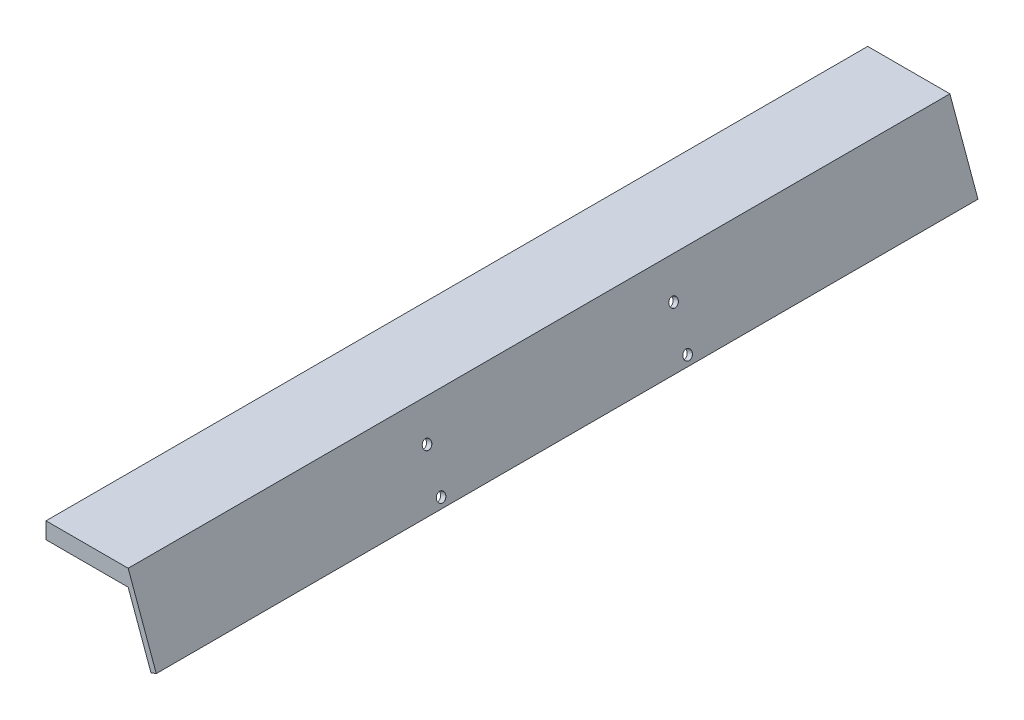
ISO-10303-21;
HEADER;
FILE_DESCRIPTION(('STEP AP214'),'2;1');
FILE_NAME('part.step','',(''),(''),'','','');
FILE_SCHEMA(('AUTOMOTIVE_DESIGN { 1 0 10303 214 1 1 1 1 }'));
ENDSEC;
DATA;
#1=APPLICATION_CONTEXT('core data for automotive mechanical design processes');
#2=APPLICATION_PROTOCOL_DEFINITION('international standard','automotive_design',2000,#1);
#3=PRODUCT_CONTEXT('',#1,'mechanical');
#4=PRODUCT('Part','Part','',(#3));
#5=PRODUCT_RELATED_PRODUCT_CATEGORY('part','',(#4));
#6=PRODUCT_DEFINITION_FORMATION('','',#4);
#7=PRODUCT_DEFINITION_CONTEXT('part definition',#1,'design');
#8=PRODUCT_DEFINITION('design','',#6,#7);
#9=PRODUCT_DEFINITION_SHAPE('','',#8);
#10=(LENGTH_UNIT() NAMED_UNIT(*) SI_UNIT(.MILLI.,.METRE.));
#11=(NAMED_UNIT(*) PLANE_ANGLE_UNIT() SI_UNIT($,.RADIAN.));
#12=(NAMED_UNIT(*) SI_UNIT($,.STERADIAN.) SOLID_ANGLE_UNIT());
#13=UNCERTAINTY_MEASURE_WITH_UNIT(LENGTH_MEASURE(1.E-05),#10,'distance_accuracy_value','');
#14=(GEOMETRIC_REPRESENTATION_CONTEXT(3) GLOBAL_UNCERTAINTY_ASSIGNED_CONTEXT((#13)) GLOBAL_UNIT_ASSIGNED_CONTEXT((#10,
#11,#12)) REPRESENTATION_CONTEXT('',''));
#15=CARTESIAN_POINT('',(0.,0.,0.));
#16=DIRECTION('',(0.,0.,1.));
#17=DIRECTION('',(1.,0.,0.));
#18=AXIS2_PLACEMENT_3D('',#15,#16,#17);
#19=CARTESIAN_POINT('',(0.,-10.,500.));
#20=DIRECTION('',(1.,0.,0.));
#21=DIRECTION('',(0.,0.,-1.));
#22=AXIS2_PLACEMENT_3D('',#19,#20,#21);
#23=PLANE('',#22);
#24=DIRECTION('',(0.,-1.,0.));
#25=VECTOR('',#24,1.);
#26=CARTESIAN_POINT('',(0.,-10.,0.));
#27=LINE('',#26,#25);
#28=CARTESIAN_POINT('',(0.,0.,0.));
#29=VERTEX_POINT('',#28);
#30=CARTESIAN_POINT('',(0.,-10.,0.));
#31=VERTEX_POINT('',#30);
#32=EDGE_CURVE('E136',#29,#31,#27,.T.);
#33=ORIENTED_EDGE('',*,*,#32,.T.);
#34=DIRECTION('',(0.,0.,-1.));
#35=VECTOR('',#34,1.);
#36=CARTESIAN_POINT('',(0.,-10.,500.));
#37=LINE('',#36,#35);
#38=CARTESIAN_POINT('',(0.,-10.,500.));
#39=VERTEX_POINT('',#38);
#40=EDGE_CURVE('E11',#39,#31,#37,.T.);
#41=ORIENTED_EDGE('',*,*,#40,.F.);
#42=DIRECTION('',(0.,-1.,0.));
#43=VECTOR('',#42,1.);
#44=CARTESIAN_POINT('',(0.,-10.,500.));
#45=LINE('',#44,#43);
#46=CARTESIAN_POINT('',(0.,0.,500.));
#47=VERTEX_POINT('',#46);
#48=EDGE_CURVE('E153',#47,#39,#45,.T.);
#49=ORIENTED_EDGE('',*,*,#48,.F.);
#50=DIRECTION('',(0.,0.,-1.));
#51=VECTOR('',#50,1.);
#52=CARTESIAN_POINT('',(0.,0.,500.));
#53=LINE('',#52,#51);
#54=EDGE_CURVE('E132',#47,#29,#53,.T.);
#55=ORIENTED_EDGE('',*,*,#54,.T.);
#56=EDGE_LOOP('',(#33,#41,#49,#55));
#57=FACE_BOUND('',#56,.T.);
#58=ADVANCED_FACE('F45',(#57),#23,.F.);
#59=CARTESIAN_POINT('',(50.,-9.99999999999999,500.));
#60=DIRECTION('',(0.,1.,0.));
#61=DIRECTION('',(-1.,0.,0.));
#62=AXIS2_PLACEMENT_3D('',#59,#60,#61);
#63=PLANE('',#62);
#64=DIRECTION('',(1.,0.,0.));
#65=VECTOR('',#64,1.);
#66=CARTESIAN_POINT('',(50.,-9.99999999999999,0.));
#67=LINE('',#66,#65);
#68=CARTESIAN_POINT('',(50.,-9.99999999999999,0.));
#69=VERTEX_POINT('',#68);
#70=EDGE_CURVE('E140',#31,#69,#67,.T.);
#71=ORIENTED_EDGE('',*,*,#70,.T.);
#72=DIRECTION('',(0.,0.,-1.));
#73=VECTOR('',#72,1.);
#74=CARTESIAN_POINT('',(50.,-9.99999999999999,500.));
#75=LINE('',#74,#73);
#76=CARTESIAN_POINT('',(50.,-9.99999999999999,500.));
#77=VERTEX_POINT('',#76);
#78=EDGE_CURVE('E55',#77,#69,#75,.T.);
#79=ORIENTED_EDGE('',*,*,#78,.F.);
#80=DIRECTION('',(1.,0.,0.));
#81=VECTOR('',#80,1.);
#82=CARTESIAN_POINT('',(50.,-9.99999999999999,500.));
#83=LINE('',#82,#81);
#84=EDGE_CURVE('E101',#39,#77,#83,.T.);
#85=ORIENTED_EDGE('',*,*,#84,.F.);
#86=ORIENTED_EDGE('',*,*,#40,.T.);
#87=EDGE_LOOP('',(#71,#79,#85,#86));
#88=FACE_BOUND('',#87,.T.);
#89=ADVANCED_FACE('F208',(#88),#63,.F.);
#90=CARTESIAN_POINT('',(63.8870691178505,-48.1544088237006,500.));
#91=DIRECTION('',(0.939692620785911,0.342020143325663,0.));
#92=DIRECTION('',(-0.342020143325663,0.93969262078591,0.));
#93=AXIS2_PLACEMENT_3D('',#90,#91,#92);
#94=PLANE('',#93);
#95=CARTESIAN_POINT('',(53.6404510040889,-20.0020569303652,325.));
#96=DIRECTION('',(0.939692620785911,0.342020143325663,0.));
#97=DIRECTION('',(-0.342020143325663,0.93969262078591,0.));
#98=AXIS2_PLACEMENT_3D('',#95,#96,#97);
#99=CIRCLE('',#98,2.74999999999997);
#100=CARTESIAN_POINT('',(52.6998956099433,-17.417902223204,325.));
#101=VERTEX_POINT('',#100);
#102=EDGE_CURVE('E48',#101,#101,#99,.T.);
#103=ORIENTED_EDGE('',*,*,#102,.T.);
#104=EDGE_LOOP('',(#103));
#105=FACE_BOUND('',#104,.T.);
#106=CARTESIAN_POINT('',(62.1909545872304,-43.494372450013,325.));
#107=DIRECTION('',(0.939692620785911,0.342020143325663,0.));
#108=DIRECTION('',(-0.342020143325663,0.93969262078591,0.));
#109=AXIS2_PLACEMENT_3D('',#106,#107,#108);
#110=CIRCLE('',#109,2.74999999999997);
#111=CARTESIAN_POINT('',(61.2503991930849,-40.9102177428518,325.));
#112=VERTEX_POINT('',#111);
#113=EDGE_CURVE('E172',#112,#112,#110,.T.);
#114=ORIENTED_EDGE('',*,*,#113,.T.);
#115=EDGE_LOOP('',(#114));
#116=FACE_BOUND('',#115,.T.);
#117=CARTESIAN_POINT('',(62.1909545872304,-43.494372450013,175.));
#118=DIRECTION('',(0.939692620785911,0.342020143325663,0.));
#119=DIRECTION('',(-0.342020143325663,0.93969262078591,0.));
#120=AXIS2_PLACEMENT_3D('',#117,#118,#119);
#121=CIRCLE('',#120,2.74999999999999);
#122=CARTESIAN_POINT('',(61.2503991930849,-40.9102177428517,175.));
#123=VERTEX_POINT('',#122);
#124=EDGE_CURVE('E167',#123,#123,#121,.T.);
#125=ORIENTED_EDGE('',*,*,#124,.T.);
#126=EDGE_LOOP('',(#125));
#127=FACE_BOUND('',#126,.T.);
#128=CARTESIAN_POINT('',(53.6404510040889,-20.0020569303652,175.));
#129=DIRECTION('',(0.939692620785911,0.342020143325663,0.));
#130=DIRECTION('',(-0.342020143325663,0.93969262078591,0.));
#131=AXIS2_PLACEMENT_3D('',#128,#129,#130);
#132=CIRCLE('',#131,2.74999999999999);
#133=CARTESIAN_POINT('',(52.6998956099433,-17.417902223204,175.));
#134=VERTEX_POINT('',#133);
#135=EDGE_CURVE('E141',#134,#134,#132,.T.);
#136=ORIENTED_EDGE('',*,*,#135,.T.);
#137=EDGE_LOOP('',(#136));
#138=FACE_BOUND('',#137,.T.);
#139=DIRECTION('',(0.342020143325663,-0.93969262078591,0.));
#140=VECTOR('',#139,1.);
#141=CARTESIAN_POINT('',(63.8870691178505,-48.1544088237006,0.));
#142=LINE('',#141,#140);
#143=CARTESIAN_POINT('',(63.8870691178505,-48.1544088237006,0.));
#144=VERTEX_POINT('',#143);
#145=EDGE_CURVE('E144',#69,#144,#142,.T.);
#146=ORIENTED_EDGE('',*,*,#145,.T.);
#147=DIRECTION('',(0.,0.,-1.));
#148=VECTOR('',#147,1.);
#149=CARTESIAN_POINT('',(63.8870691178505,-48.1544088237006,500.));
#150=LINE('',#149,#148);
#151=CARTESIAN_POINT('',(63.8870691178505,-48.1544088237006,500.));
#152=VERTEX_POINT('',#151);
#153=EDGE_CURVE('E125',#152,#144,#150,.T.);
#154=ORIENTED_EDGE('',*,*,#153,.F.);
#155=DIRECTION('',(0.342020143325663,-0.93969262078591,0.));
#156=VECTOR('',#155,1.);
#157=CARTESIAN_POINT('',(63.8870691178505,-48.1544088237006,500.));
#158=LINE('',#157,#156);
#159=EDGE_CURVE('E114',#77,#152,#158,.T.);
#160=ORIENTED_EDGE('',*,*,#159,.F.);
#161=ORIENTED_EDGE('',*,*,#78,.T.);
#162=EDGE_LOOP('',(#146,#154,#160,#161));
#163=FACE_BOUND('',#162,.T.);
#164=ADVANCED_FACE('F211',(#105,#116,#127,#138,#163),#94,.F.);
#165=CARTESIAN_POINT('',(67.1010071662832,-46.9846310392955,500.));
#166=DIRECTION('',(-0.342020143325664,0.93969262078591,0.));
#167=DIRECTION('',(-0.93969262078591,-0.342020143325664,0.));
#168=AXIS2_PLACEMENT_3D('',#165,#166,#167);
#169=PLANE('',#168);
#170=DIRECTION('',(0.93969262078591,0.342020143325664,0.));
#171=VECTOR('',#170,1.);
#172=CARTESIAN_POINT('',(67.1010071662832,-46.9846310392955,0.));
#173=LINE('',#172,#171);
#174=CARTESIAN_POINT('',(67.1010071662832,-46.9846310392955,0.));
#175=VERTEX_POINT('',#174);
#176=EDGE_CURVE('E123',#144,#175,#173,.T.);
#177=ORIENTED_EDGE('',*,*,#176,.T.);
#178=DIRECTION('',(0.,0.,-1.));
#179=VECTOR('',#178,1.);
#180=CARTESIAN_POINT('',(67.1010071662832,-46.9846310392955,500.));
#181=LINE('',#180,#179);
#182=CARTESIAN_POINT('',(67.1010071662832,-46.9846310392955,500.));
#183=VERTEX_POINT('',#182);
#184=EDGE_CURVE('E120',#183,#175,#181,.T.);
#185=ORIENTED_EDGE('',*,*,#184,.F.);
#186=DIRECTION('',(0.93969262078591,0.342020143325664,0.));
#187=VECTOR('',#186,1.);
#188=CARTESIAN_POINT('',(67.1010071662832,-46.9846310392955,500.));
#189=LINE('',#188,#187);
#190=EDGE_CURVE('E108',#152,#183,#189,.T.);
#191=ORIENTED_EDGE('',*,*,#190,.F.);
#192=ORIENTED_EDGE('',*,*,#153,.T.);
#193=EDGE_LOOP('',(#177,#185,#191,#192));
#194=FACE_BOUND('',#193,.T.);
#195=ADVANCED_FACE('F121',(#194),#169,.F.);
#196=CARTESIAN_POINT('',(50.,0.,500.));
#197=DIRECTION('',(-0.93969262078591,-0.342020143325663,0.));
#198=DIRECTION('',(0.342020143325663,-0.93969262078591,0.));
#199=AXIS2_PLACEMENT_3D('',#196,#197,#198);
#200=PLANE('',#199);
#201=CARTESIAN_POINT('',(56.8543890525215,-18.8322791459602,325.));
#202=DIRECTION('',(0.93969262078591,0.342020143325663,0.));
#203=DIRECTION('',(-0.342020143325663,0.93969262078591,0.));
#204=AXIS2_PLACEMENT_3D('',#201,#202,#203);
#205=CIRCLE('',#204,2.77500000000003);
#206=CARTESIAN_POINT('',(55.9052831547928,-16.2246321232792,325.));
#207=VERTEX_POINT('',#206);
#208=EDGE_CURVE('E430',#207,#207,#205,.T.);
#209=ORIENTED_EDGE('',*,*,#208,.F.);
#210=EDGE_LOOP('',(#209));
#211=FACE_BOUND('',#210,.T.);
#212=CARTESIAN_POINT('',(65.4048926356631,-42.3245946656079,325.));
#213=DIRECTION('',(0.93969262078591,0.342020143325663,0.));
#214=DIRECTION('',(-0.342020143325663,0.93969262078591,0.));
#215=AXIS2_PLACEMENT_3D('',#212,#213,#214);
#216=CIRCLE('',#215,2.77500000000003);
#217=CARTESIAN_POINT('',(64.4557867379344,-39.716947642927,325.));
#218=VERTEX_POINT('',#217);
#219=EDGE_CURVE('E184',#218,#218,#216,.T.);
#220=ORIENTED_EDGE('',*,*,#219,.F.);
#221=EDGE_LOOP('',(#220));
#222=FACE_BOUND('',#221,.T.);
#223=CARTESIAN_POINT('',(65.4048926356631,-42.3245946656079,175.));
#224=DIRECTION('',(0.93969262078591,0.342020143325663,0.));
#225=DIRECTION('',(-0.342020143325663,0.93969262078591,0.));
#226=AXIS2_PLACEMENT_3D('',#223,#224,#225);
#227=CIRCLE('',#226,2.775);
#228=CARTESIAN_POINT('',(64.4557867379344,-39.716947642927,175.));
#229=VERTEX_POINT('',#228);
#230=EDGE_CURVE('E175',#229,#229,#227,.T.);
#231=ORIENTED_EDGE('',*,*,#230,.F.);
#232=EDGE_LOOP('',(#231));
#233=FACE_BOUND('',#232,.T.);
#234=CARTESIAN_POINT('',(56.8543890525215,-18.8322791459601,175.));
#235=DIRECTION('',(0.93969262078591,0.342020143325663,0.));
#236=DIRECTION('',(-0.342020143325663,0.93969262078591,0.));
#237=AXIS2_PLACEMENT_3D('',#234,#235,#236);
#238=CIRCLE('',#237,2.775);
#239=CARTESIAN_POINT('',(55.9052831547928,-16.2246321232792,175.));
#240=VERTEX_POINT('',#239);
#241=EDGE_CURVE('E170',#240,#240,#238,.T.);
#242=ORIENTED_EDGE('',*,*,#241,.F.);
#243=EDGE_LOOP('',(#242));
#244=FACE_BOUND('',#243,.T.);
#245=DIRECTION('',(-0.342020143325663,0.93969262078591,0.));
#246=VECTOR('',#245,1.);
#247=CARTESIAN_POINT('',(50.,0.,0.));
#248=LINE('',#247,#246);
#249=CARTESIAN_POINT('',(50.,0.,0.));
#250=VERTEX_POINT('',#249);
#251=EDGE_CURVE('E87',#175,#250,#248,.T.);
#252=ORIENTED_EDGE('',*,*,#251,.T.);
#253=DIRECTION('',(0.,0.,-1.));
#254=VECTOR('',#253,1.);
#255=CARTESIAN_POINT('',(50.,0.,500.));
#256=LINE('',#255,#254);
#257=CARTESIAN_POINT('',(50.,0.,500.));
#258=VERTEX_POINT('',#257);
#259=EDGE_CURVE('E126',#258,#250,#256,.T.);
#260=ORIENTED_EDGE('',*,*,#259,.F.);
#261=DIRECTION('',(-0.342020143325663,0.93969262078591,0.));
#262=VECTOR('',#261,1.);
#263=CARTESIAN_POINT('',(50.,0.,500.));
#264=LINE('',#263,#262);
#265=EDGE_CURVE('E112',#183,#258,#264,.T.);
#266=ORIENTED_EDGE('',*,*,#265,.F.);
#267=ORIENTED_EDGE('',*,*,#184,.T.);
#268=EDGE_LOOP('',(#252,#260,#266,#267));
#269=FACE_BOUND('',#268,.T.);
#270=ADVANCED_FACE('F128',(#211,#222,#233,#244,#269),#200,.F.);
#271=CARTESIAN_POINT('',(0.,0.,500.));
#272=DIRECTION('',(0.,-1.,0.));
#273=DIRECTION('',(0.,0.,-1.));
#274=AXIS2_PLACEMENT_3D('',#271,#272,#273);
#275=PLANE('',#274);
#276=DIRECTION('',(-1.,0.,0.));
#277=VECTOR('',#276,1.);
#278=CARTESIAN_POINT('',(0.,0.,0.));
#279=LINE('',#278,#277);
#280=EDGE_CURVE('E93',#250,#29,#279,.T.);
#281=ORIENTED_EDGE('',*,*,#280,.T.);
#282=ORIENTED_EDGE('',*,*,#54,.F.);
#283=DIRECTION('',(-1.,0.,0.));
#284=VECTOR('',#283,1.);
#285=CARTESIAN_POINT('',(0.,0.,500.));
#286=LINE('',#285,#284);
#287=EDGE_CURVE('E64',#258,#47,#286,.T.);
#288=ORIENTED_EDGE('',*,*,#287,.F.);
#289=ORIENTED_EDGE('',*,*,#259,.T.);
#290=EDGE_LOOP('',(#281,#282,#288,#289));
#291=FACE_BOUND('',#290,.T.);
#292=ADVANCED_FACE('F216',(#291),#275,.F.);
#293=CARTESIAN_POINT('',(0.,0.,500.));
#294=DIRECTION('',(0.,0.,-1.));
#295=DIRECTION('',(-1.,0.,0.));
#296=AXIS2_PLACEMENT_3D('',#293,#294,#295);
#297=PLANE('',#296);
#298=ORIENTED_EDGE('',*,*,#48,.T.);
#299=ORIENTED_EDGE('',*,*,#84,.T.);
#300=ORIENTED_EDGE('',*,*,#159,.T.);
#301=ORIENTED_EDGE('',*,*,#190,.T.);
#302=ORIENTED_EDGE('',*,*,#265,.T.);
#303=ORIENTED_EDGE('',*,*,#287,.T.);
#304=EDGE_LOOP('',(#298,#299,#300,#301,#302,#303));
#305=FACE_BOUND('',#304,.T.);
#306=ADVANCED_FACE('F110',(#305),#297,.F.);
#307=CARTESIAN_POINT('',(0.,0.,0.));
#308=DIRECTION('',(0.,0.,-1.));
#309=DIRECTION('',(-1.,0.,0.));
#310=AXIS2_PLACEMENT_3D('',#307,#308,#309);
#311=PLANE('',#310);
#312=ORIENTED_EDGE('',*,*,#32,.F.);
#313=ORIENTED_EDGE('',*,*,#280,.F.);
#314=ORIENTED_EDGE('',*,*,#251,.F.);
#315=ORIENTED_EDGE('',*,*,#176,.F.);
#316=ORIENTED_EDGE('',*,*,#145,.F.);
#317=ORIENTED_EDGE('',*,*,#70,.F.);
#318=EDGE_LOOP('',(#312,#313,#314,#315,#316,#317));
#319=FACE_BOUND('',#318,.T.);
#320=ADVANCED_FACE('F214',(#319),#311,.T.);
#321=CARTESIAN_POINT('',(56.8543890525215,-18.8322791459601,175.));
#322=DIRECTION('',(0.93969262078591,0.342020143325663,0.));
#323=DIRECTION('',(-0.342020143325663,0.93969262078591,0.));
#324=AXIS2_PLACEMENT_3D('',#321,#322,#323);
#325=CYLINDRICAL_SURFACE('',#324,2.74999999999999);
#326=CARTESIAN_POINT('',(56.8308967370019,-18.8408296495433,175.));
#327=DIRECTION('',(0.93969262078591,0.342020143325663,0.));
#328=DIRECTION('',(-0.342020143325663,0.93969262078591,0.));
#329=AXIS2_PLACEMENT_3D('',#326,#327,#328);
#330=CIRCLE('',#329,2.75);
#331=CARTESIAN_POINT('',(55.8903413428563,-16.256674942382,175.));
#332=VERTEX_POINT('',#331);
#333=EDGE_CURVE('E166',#332,#332,#330,.T.);
#334=ORIENTED_EDGE('',*,*,#333,.T.);
#335=EDGE_LOOP('',(#334));
#336=FACE_BOUND('',#335,.T.);
#337=ORIENTED_EDGE('',*,*,#135,.F.);
#338=EDGE_LOOP('',(#337));
#339=FACE_BOUND('',#338,.T.);
#340=ADVANCED_FACE('F267',(#336,#339),#325,.F.);
#341=CARTESIAN_POINT('',(56.8543890525215,-18.8322791459601,175.));
#342=DIRECTION('',(0.93969262078591,0.342020143325663,0.));
#343=DIRECTION('',(-0.342020143325663,0.93969262078591,0.));
#344=AXIS2_PLACEMENT_3D('',#341,#342,#343);
#345=CONICAL_SURFACE('',#344,2.775,0.785398163397146);
#346=ORIENTED_EDGE('',*,*,#333,.F.);
#347=EDGE_LOOP('',(#346));
#348=FACE_BOUND('',#347,.T.);
#349=ORIENTED_EDGE('',*,*,#241,.T.);
#350=EDGE_LOOP('',(#349));
#351=FACE_BOUND('',#350,.T.);
#352=ADVANCED_FACE('F274',(#348,#351),#345,.F.);
#353=CARTESIAN_POINT('',(65.4048926356631,-42.3245946656079,175.));
#354=DIRECTION('',(0.93969262078591,0.342020143325663,0.));
#355=DIRECTION('',(-0.342020143325663,0.93969262078591,0.));
#356=AXIS2_PLACEMENT_3D('',#353,#354,#355);
#357=CYLINDRICAL_SURFACE('',#356,2.74999999999999);
#358=CARTESIAN_POINT('',(65.3814003201434,-42.3331451691911,175.));
#359=DIRECTION('',(0.93969262078591,0.342020143325663,0.));
#360=DIRECTION('',(-0.342020143325663,0.93969262078591,0.));
#361=AXIS2_PLACEMENT_3D('',#358,#359,#360);
#362=CIRCLE('',#361,2.75);
#363=CARTESIAN_POINT('',(64.4408449259979,-39.7489904620298,175.));
#364=VERTEX_POINT('',#363);
#365=EDGE_CURVE('E171',#364,#364,#362,.T.);
#366=ORIENTED_EDGE('',*,*,#365,.T.);
#367=EDGE_LOOP('',(#366));
#368=FACE_BOUND('',#367,.T.);
#369=ORIENTED_EDGE('',*,*,#124,.F.);
#370=EDGE_LOOP('',(#369));
#371=FACE_BOUND('',#370,.T.);
#372=ADVANCED_FACE('F284',(#368,#371),#357,.F.);
#373=CARTESIAN_POINT('',(65.4048926356631,-42.3245946656079,175.));
#374=DIRECTION('',(0.93969262078591,0.342020143325663,0.));
#375=DIRECTION('',(-0.342020143325663,0.93969262078591,0.));
#376=AXIS2_PLACEMENT_3D('',#373,#374,#375);
#377=CONICAL_SURFACE('',#376,2.775,0.7853981633973);
#378=ORIENTED_EDGE('',*,*,#365,.F.);
#379=EDGE_LOOP('',(#378));
#380=FACE_BOUND('',#379,.T.);
#381=ORIENTED_EDGE('',*,*,#230,.T.);
#382=EDGE_LOOP('',(#381));
#383=FACE_BOUND('',#382,.T.);
#384=ADVANCED_FACE('F294',(#380,#383),#377,.F.);
#385=CARTESIAN_POINT('',(65.4048926356631,-42.3245946656079,325.));
#386=DIRECTION('',(0.93969262078591,0.342020143325663,0.));
#387=DIRECTION('',(-0.342020143325663,0.93969262078591,0.));
#388=AXIS2_PLACEMENT_3D('',#385,#386,#387);
#389=CYLINDRICAL_SURFACE('',#388,2.74999999999997);
#390=CARTESIAN_POINT('',(65.3814003201434,-42.3331451691911,325.));
#391=DIRECTION('',(0.93969262078591,0.342020143325663,0.));
#392=DIRECTION('',(-0.342020143325663,0.93969262078591,0.));
#393=AXIS2_PLACEMENT_3D('',#390,#391,#392);
#394=CIRCLE('',#393,2.74999999999997);
#395=CARTESIAN_POINT('',(64.4408449259979,-39.7489904620298,325.));
#396=VERTEX_POINT('',#395);
#397=EDGE_CURVE('E176',#396,#396,#394,.T.);
#398=ORIENTED_EDGE('',*,*,#397,.T.);
#399=EDGE_LOOP('',(#398));
#400=FACE_BOUND('',#399,.T.);
#401=ORIENTED_EDGE('',*,*,#113,.F.);
#402=EDGE_LOOP('',(#401));
#403=FACE_BOUND('',#402,.T.);
#404=ADVANCED_FACE('F304',(#400,#403),#389,.F.);
#405=CARTESIAN_POINT('',(65.4048926356631,-42.3245946656079,325.));
#406=DIRECTION('',(0.93969262078591,0.342020143325663,0.));
#407=DIRECTION('',(-0.342020143325663,0.93969262078591,0.));
#408=AXIS2_PLACEMENT_3D('',#405,#406,#407);
#409=CONICAL_SURFACE('',#408,2.77500000000003,0.78539816339841);
#410=ORIENTED_EDGE('',*,*,#397,.F.);
#411=EDGE_LOOP('',(#410));
#412=FACE_BOUND('',#411,.T.);
#413=ORIENTED_EDGE('',*,*,#219,.T.);
#414=EDGE_LOOP('',(#413));
#415=FACE_BOUND('',#414,.T.);
#416=ADVANCED_FACE('F314',(#412,#415),#409,.F.);
#417=CARTESIAN_POINT('',(56.8543890525215,-18.8322791459602,325.));
#418=DIRECTION('',(0.93969262078591,0.342020143325663,0.));
#419=DIRECTION('',(-0.342020143325663,0.93969262078591,0.));
#420=AXIS2_PLACEMENT_3D('',#417,#418,#419);
#421=CYLINDRICAL_SURFACE('',#420,2.74999999999997);
#422=CARTESIAN_POINT('',(56.8308967370019,-18.8408296495433,325.));
#423=DIRECTION('',(0.93969262078591,0.342020143325663,0.));
#424=DIRECTION('',(-0.342020143325663,0.93969262078591,0.));
#425=AXIS2_PLACEMENT_3D('',#422,#423,#424);
#426=CIRCLE('',#425,2.74999999999997);
#427=CARTESIAN_POINT('',(55.8903413428563,-16.2566749423821,325.));
#428=VERTEX_POINT('',#427);
#429=EDGE_CURVE('E427',#428,#428,#426,.T.);
#430=ORIENTED_EDGE('',*,*,#429,.T.);
#431=EDGE_LOOP('',(#430));
#432=FACE_BOUND('',#431,.T.);
#433=ORIENTED_EDGE('',*,*,#102,.F.);
#434=EDGE_LOOP('',(#433));
#435=FACE_BOUND('',#434,.T.);
#436=ADVANCED_FACE('F323',(#432,#435),#421,.F.);
#437=CARTESIAN_POINT('',(56.8543890525215,-18.8322791459602,325.));
#438=DIRECTION('',(0.93969262078591,0.342020143325663,0.));
#439=DIRECTION('',(-0.342020143325663,0.93969262078591,0.));
#440=AXIS2_PLACEMENT_3D('',#437,#438,#439);
#441=CONICAL_SURFACE('',#440,2.77500000000003,0.785398163398256);
#442=ORIENTED_EDGE('',*,*,#429,.F.);
#443=EDGE_LOOP('',(#442));
#444=FACE_BOUND('',#443,.T.);
#445=ORIENTED_EDGE('',*,*,#208,.T.);
#446=EDGE_LOOP('',(#445));
#447=FACE_BOUND('',#446,.T.);
#448=ADVANCED_FACE('F333',(#444,#447),#441,.F.);
#449=CLOSED_SHELL('',(#58,#89,#164,#195,#270,#292,#306,#320,#340,#352,#372,#384,#404,#416,#436,#448));
#450=MANIFOLD_SOLID_BREP('B2',#449);
#451=ADVANCED_BREP_SHAPE_REPRESENTATION('',(#18,#450),#14);
#452=SHAPE_DEFINITION_REPRESENTATION(#9,#451);
ENDSEC;
END-ISO-10303-21;
